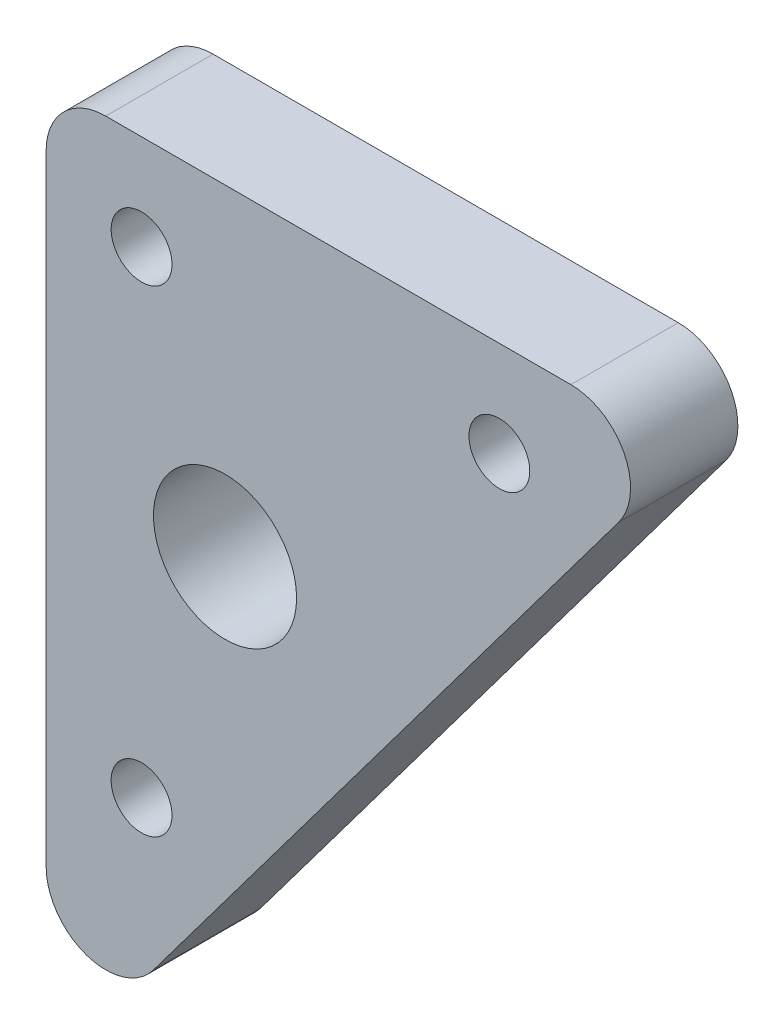
ISO-10303-21;
HEADER;
FILE_DESCRIPTION(('STEP AP214'),'2;1');
FILE_NAME('part.step','',(''),(''),'','','');
FILE_SCHEMA(('AUTOMOTIVE_DESIGN { 1 0 10303 214 1 1 1 1 }'));
ENDSEC;
DATA;
#1=APPLICATION_CONTEXT('core data for automotive mechanical design processes');
#2=APPLICATION_PROTOCOL_DEFINITION('international standard','automotive_design',2000,#1);
#3=PRODUCT_CONTEXT('',#1,'mechanical');
#4=PRODUCT('Part','Part','',(#3));
#5=PRODUCT_RELATED_PRODUCT_CATEGORY('part','',(#4));
#6=PRODUCT_DEFINITION_FORMATION('','',#4);
#7=PRODUCT_DEFINITION_CONTEXT('part definition',#1,'design');
#8=PRODUCT_DEFINITION('design','',#6,#7);
#9=PRODUCT_DEFINITION_SHAPE('','',#8);
#10=(LENGTH_UNIT() NAMED_UNIT(*) SI_UNIT(.MILLI.,.METRE.));
#11=(NAMED_UNIT(*) PLANE_ANGLE_UNIT() SI_UNIT($,.RADIAN.));
#12=(NAMED_UNIT(*) SI_UNIT($,.STERADIAN.) SOLID_ANGLE_UNIT());
#13=UNCERTAINTY_MEASURE_WITH_UNIT(LENGTH_MEASURE(1.E-05),#10,'distance_accuracy_value','');
#14=(GEOMETRIC_REPRESENTATION_CONTEXT(3) GLOBAL_UNCERTAINTY_ASSIGNED_CONTEXT((#13)) GLOBAL_UNIT_ASSIGNED_CONTEXT((#10,
#11,#12)) REPRESENTATION_CONTEXT('',''));
#15=CARTESIAN_POINT('',(0.,0.,0.));
#16=DIRECTION('',(0.,0.,1.));
#17=DIRECTION('',(1.,0.,0.));
#18=AXIS2_PLACEMENT_3D('',#15,#16,#17);
#19=CARTESIAN_POINT('',(0.,0.,9.));
#20=DIRECTION('',(0.,0.,-1.));
#21=DIRECTION('',(-1.,0.,0.));
#22=AXIS2_PLACEMENT_3D('',#19,#20,#21);
#23=PLANE('',#22);
#24=DIRECTION('',(0.,-1.,0.));
#25=VECTOR('',#24,1.);
#26=CARTESIAN_POINT('',(-19.7283950617284,-51.8395061728395,9.));
#27=LINE('',#26,#25);
#28=CARTESIAN_POINT('',(-19.7283950617284,15.1604938271605,9.));
#29=VERTEX_POINT('',#28);
#30=CARTESIAN_POINT('',(-19.7283950617284,-36.8395061728395,9.));
#31=VERTEX_POINT('',#30);
#32=EDGE_CURVE('E118',#29,#31,#27,.T.);
#33=ORIENTED_EDGE('',*,*,#32,.T.);
#34=CARTESIAN_POINT('',(-14.7283950617284,-36.8395061728395,9.));
#35=DIRECTION('',(0.,0.,-1.));
#36=DIRECTION('',(-1.,0.,0.));
#37=AXIS2_PLACEMENT_3D('',#34,#35,#36);
#38=CIRCLE('',#37,5.);
#39=CARTESIAN_POINT('',(-10.7283950617284,-39.8395061728395,9.));
#40=VERTEX_POINT('',#39);
#41=EDGE_CURVE('E134',#31,#40,#38,.F.);
#42=ORIENTED_EDGE('',*,*,#41,.T.);
#43=DIRECTION('',(0.6,0.8,0.));
#44=VECTOR('',#43,1.);
#45=CARTESIAN_POINT('',(34.2716049382716,20.1604938271605,9.));
#46=LINE('',#45,#44);
#47=CARTESIAN_POINT('',(28.2716049382716,12.1604938271605,9.));
#48=VERTEX_POINT('',#47);
#49=EDGE_CURVE('E108',#40,#48,#46,.T.);
#50=ORIENTED_EDGE('',*,*,#49,.T.);
#51=CARTESIAN_POINT('',(24.2716049382716,15.1604938271605,9.));
#52=DIRECTION('',(0.,0.,-1.));
#53=DIRECTION('',(-1.,0.,0.));
#54=AXIS2_PLACEMENT_3D('',#51,#52,#53);
#55=CIRCLE('',#54,5.);
#56=CARTESIAN_POINT('',(24.2716049382716,20.1604938271605,9.));
#57=VERTEX_POINT('',#56);
#58=EDGE_CURVE('E56',#48,#57,#55,.F.);
#59=ORIENTED_EDGE('',*,*,#58,.T.);
#60=DIRECTION('',(-1.,0.,0.));
#61=VECTOR('',#60,1.);
#62=CARTESIAN_POINT('',(-19.7283950617284,20.1604938271605,9.));
#63=LINE('',#62,#61);
#64=CARTESIAN_POINT('',(-14.7283950617284,20.1604938271605,9.));
#65=VERTEX_POINT('',#64);
#66=EDGE_CURVE('E124',#57,#65,#63,.T.);
#67=ORIENTED_EDGE('',*,*,#66,.T.);
#68=CARTESIAN_POINT('',(-14.7283950617284,15.1604938271605,9.));
#69=DIRECTION('',(0.,0.,-1.));
#70=DIRECTION('',(-1.,0.,0.));
#71=AXIS2_PLACEMENT_3D('',#68,#69,#70);
#72=CIRCLE('',#71,5.);
#73=EDGE_CURVE('E131',#65,#29,#72,.F.);
#74=ORIENTED_EDGE('',*,*,#73,.T.);
#75=EDGE_LOOP('',(#33,#42,#50,#59,#67,#74));
#76=FACE_BOUND('',#75,.T.);
#77=CARTESIAN_POINT('',(-11.7283950617284,12.1604938271605,9.));
#78=DIRECTION('',(0.,0.,1.));
#79=DIRECTION('',(1.,0.,0.));
#80=AXIS2_PLACEMENT_3D('',#77,#78,#79);
#81=CIRCLE('',#80,2.55);
#82=CARTESIAN_POINT('',(-9.17839506172839,12.1604938271605,9.));
#83=VERTEX_POINT('',#82);
#84=EDGE_CURVE('E120',#83,#83,#81,.T.);
#85=ORIENTED_EDGE('',*,*,#84,.F.);
#86=EDGE_LOOP('',(#85));
#87=FACE_BOUND('',#86,.T.);
#88=CARTESIAN_POINT('',(18.2716049382716,12.1604938271605,9.));
#89=DIRECTION('',(0.,0.,1.));
#90=DIRECTION('',(1.,0.,0.));
#91=AXIS2_PLACEMENT_3D('',#88,#89,#90);
#92=CIRCLE('',#91,2.55);
#93=CARTESIAN_POINT('',(20.8216049382716,12.1604938271605,9.));
#94=VERTEX_POINT('',#93);
#95=EDGE_CURVE('E273',#94,#94,#92,.T.);
#96=ORIENTED_EDGE('',*,*,#95,.F.);
#97=EDGE_LOOP('',(#96));
#98=FACE_BOUND('',#97,.T.);
#99=CARTESIAN_POINT('',(-11.7283950617284,-27.8395061728395,9.));
#100=DIRECTION('',(0.,0.,1.));
#101=DIRECTION('',(1.,0.,0.));
#102=AXIS2_PLACEMENT_3D('',#99,#100,#101);
#103=CIRCLE('',#102,2.55);
#104=CARTESIAN_POINT('',(-9.17839506172839,-27.8395061728395,9.));
#105=VERTEX_POINT('',#104);
#106=EDGE_CURVE('E267',#105,#105,#103,.T.);
#107=ORIENTED_EDGE('',*,*,#106,.F.);
#108=EDGE_LOOP('',(#107));
#109=FACE_BOUND('',#108,.T.);
#110=CARTESIAN_POINT('',(-4.72839506172839,-6.83950617283951,9.));
#111=DIRECTION('',(0.,0.,1.));
#112=DIRECTION('',(1.,0.,0.));
#113=AXIS2_PLACEMENT_3D('',#110,#111,#112);
#114=CIRCLE('',#113,6.);
#115=CARTESIAN_POINT('',(1.27160493827161,-6.83950617283951,9.));
#116=VERTEX_POINT('',#115);
#117=EDGE_CURVE('E258',#116,#116,#114,.T.);
#118=ORIENTED_EDGE('',*,*,#117,.F.);
#119=EDGE_LOOP('',(#118));
#120=FACE_BOUND('',#119,.T.);
#121=ADVANCED_FACE('F35',(#76,#87,#98,#109,#120),#23,.F.);
#122=CARTESIAN_POINT('',(0.,0.,0.));
#123=DIRECTION('',(0.,0.,-1.));
#124=DIRECTION('',(-1.,0.,0.));
#125=AXIS2_PLACEMENT_3D('',#122,#123,#124);
#126=PLANE('',#125);
#127=CARTESIAN_POINT('',(-11.7283950617284,-27.8395061728395,0.));
#128=DIRECTION('',(0.,0.,1.));
#129=DIRECTION('',(1.,0.,0.));
#130=AXIS2_PLACEMENT_3D('',#127,#128,#129);
#131=CIRCLE('',#130,2.55);
#132=CARTESIAN_POINT('',(-9.17839506172839,-27.8395061728395,0.));
#133=VERTEX_POINT('',#132);
#134=EDGE_CURVE('E264',#133,#133,#131,.T.);
#135=ORIENTED_EDGE('',*,*,#134,.T.);
#136=EDGE_LOOP('',(#135));
#137=FACE_BOUND('',#136,.T.);
#138=CARTESIAN_POINT('',(-11.7283950617284,12.1604938271605,0.));
#139=DIRECTION('',(0.,0.,1.));
#140=DIRECTION('',(1.,0.,0.));
#141=AXIS2_PLACEMENT_3D('',#138,#139,#140);
#142=CIRCLE('',#141,2.55);
#143=CARTESIAN_POINT('',(-9.17839506172839,12.1604938271605,0.));
#144=VERTEX_POINT('',#143);
#145=EDGE_CURVE('E144',#144,#144,#142,.T.);
#146=ORIENTED_EDGE('',*,*,#145,.T.);
#147=EDGE_LOOP('',(#146));
#148=FACE_BOUND('',#147,.T.);
#149=DIRECTION('',(0.6,0.8,0.));
#150=VECTOR('',#149,1.);
#151=CARTESIAN_POINT('',(34.2716049382716,20.1604938271605,0.));
#152=LINE('',#151,#150);
#153=CARTESIAN_POINT('',(-10.7283950617284,-39.8395061728395,0.));
#154=VERTEX_POINT('',#153);
#155=CARTESIAN_POINT('',(28.2716049382716,12.1604938271605,0.));
#156=VERTEX_POINT('',#155);
#157=EDGE_CURVE('E106',#154,#156,#152,.T.);
#158=ORIENTED_EDGE('',*,*,#157,.F.);
#159=CARTESIAN_POINT('',(-14.7283950617284,-36.8395061728395,0.));
#160=DIRECTION('',(0.,0.,-1.));
#161=DIRECTION('',(-1.,0.,0.));
#162=AXIS2_PLACEMENT_3D('',#159,#160,#161);
#163=CIRCLE('',#162,5.);
#164=CARTESIAN_POINT('',(-19.7283950617284,-36.8395061728395,0.));
#165=VERTEX_POINT('',#164);
#166=EDGE_CURVE('E89',#154,#165,#163,.T.);
#167=ORIENTED_EDGE('',*,*,#166,.T.);
#168=DIRECTION('',(0.,-1.,0.));
#169=VECTOR('',#168,1.);
#170=CARTESIAN_POINT('',(-19.7283950617284,-51.8395061728395,0.));
#171=LINE('',#170,#169);
#172=CARTESIAN_POINT('',(-19.7283950617284,15.1604938271605,0.));
#173=VERTEX_POINT('',#172);
#174=EDGE_CURVE('E116',#173,#165,#171,.T.);
#175=ORIENTED_EDGE('',*,*,#174,.F.);
#176=CARTESIAN_POINT('',(-14.7283950617284,15.1604938271605,0.));
#177=DIRECTION('',(0.,0.,-1.));
#178=DIRECTION('',(-1.,0.,0.));
#179=AXIS2_PLACEMENT_3D('',#176,#177,#178);
#180=CIRCLE('',#179,5.);
#181=CARTESIAN_POINT('',(-14.7283950617284,20.1604938271605,0.));
#182=VERTEX_POINT('',#181);
#183=EDGE_CURVE('E109',#173,#182,#180,.T.);
#184=ORIENTED_EDGE('',*,*,#183,.T.);
#185=DIRECTION('',(-1.,0.,0.));
#186=VECTOR('',#185,1.);
#187=CARTESIAN_POINT('',(-19.7283950617284,20.1604938271605,0.));
#188=LINE('',#187,#186);
#189=CARTESIAN_POINT('',(24.2716049382716,20.1604938271605,0.));
#190=VERTEX_POINT('',#189);
#191=EDGE_CURVE('E115',#190,#182,#188,.T.);
#192=ORIENTED_EDGE('',*,*,#191,.F.);
#193=CARTESIAN_POINT('',(24.2716049382716,15.1604938271605,0.));
#194=DIRECTION('',(0.,0.,-1.));
#195=DIRECTION('',(-1.,0.,0.));
#196=AXIS2_PLACEMENT_3D('',#193,#194,#195);
#197=CIRCLE('',#196,5.);
#198=EDGE_CURVE('E100',#190,#156,#197,.T.);
#199=ORIENTED_EDGE('',*,*,#198,.T.);
#200=EDGE_LOOP('',(#158,#167,#175,#184,#192,#199));
#201=FACE_BOUND('',#200,.T.);
#202=CARTESIAN_POINT('',(18.2716049382716,12.1604938271605,0.));
#203=DIRECTION('',(0.,0.,1.));
#204=DIRECTION('',(1.,0.,0.));
#205=AXIS2_PLACEMENT_3D('',#202,#203,#204);
#206=CIRCLE('',#205,2.55);
#207=CARTESIAN_POINT('',(20.8216049382716,12.1604938271605,0.));
#208=VERTEX_POINT('',#207);
#209=EDGE_CURVE('E270',#208,#208,#206,.T.);
#210=ORIENTED_EDGE('',*,*,#209,.T.);
#211=EDGE_LOOP('',(#210));
#212=FACE_BOUND('',#211,.T.);
#213=CARTESIAN_POINT('',(-4.72839506172839,-6.83950617283951,0.));
#214=DIRECTION('',(0.,0.,1.));
#215=DIRECTION('',(1.,0.,0.));
#216=AXIS2_PLACEMENT_3D('',#213,#214,#215);
#217=CIRCLE('',#216,6.);
#218=CARTESIAN_POINT('',(1.27160493827161,-6.83950617283951,0.));
#219=VERTEX_POINT('',#218);
#220=EDGE_CURVE('E261',#219,#219,#217,.T.);
#221=ORIENTED_EDGE('',*,*,#220,.T.);
#222=EDGE_LOOP('',(#221));
#223=FACE_BOUND('',#222,.T.);
#224=ADVANCED_FACE('F112',(#137,#148,#201,#212,#223),#126,.T.);
#225=CARTESIAN_POINT('',(-19.7283950617284,-51.8395061728395,9.));
#226=DIRECTION('',(1.,0.,0.));
#227=DIRECTION('',(0.,1.,0.));
#228=AXIS2_PLACEMENT_3D('',#225,#226,#227);
#229=PLANE('',#228);
#230=ORIENTED_EDGE('',*,*,#174,.T.);
#231=DIRECTION('',(0.,0.,-1.));
#232=VECTOR('',#231,1.);
#233=CARTESIAN_POINT('',(-19.7283950617284,-36.8395061728395,9.));
#234=LINE('',#233,#232);
#235=EDGE_CURVE('E94',#165,#31,#234,.F.);
#236=ORIENTED_EDGE('',*,*,#235,.T.);
#237=ORIENTED_EDGE('',*,*,#32,.F.);
#238=DIRECTION('',(0.,0.,-1.));
#239=VECTOR('',#238,1.);
#240=CARTESIAN_POINT('',(-19.7283950617284,15.1604938271605,9.));
#241=LINE('',#240,#239);
#242=EDGE_CURVE('E99',#29,#173,#241,.T.);
#243=ORIENTED_EDGE('',*,*,#242,.T.);
#244=EDGE_LOOP('',(#230,#236,#237,#243));
#245=FACE_BOUND('',#244,.T.);
#246=ADVANCED_FACE('F148',(#245),#229,.F.);
#247=CARTESIAN_POINT('',(34.2716049382716,20.1604938271605,9.));
#248=DIRECTION('',(-0.8,0.6,0.));
#249=DIRECTION('',(-0.6,-0.8,0.));
#250=AXIS2_PLACEMENT_3D('',#247,#248,#249);
#251=PLANE('',#250);
#252=ORIENTED_EDGE('',*,*,#49,.F.);
#253=DIRECTION('',(0.,0.,-1.));
#254=VECTOR('',#253,1.);
#255=CARTESIAN_POINT('',(-10.7283950617284,-39.8395061728395,9.));
#256=LINE('',#255,#254);
#257=EDGE_CURVE('E93',#40,#154,#256,.T.);
#258=ORIENTED_EDGE('',*,*,#257,.T.);
#259=ORIENTED_EDGE('',*,*,#157,.T.);
#260=DIRECTION('',(0.,0.,-1.));
#261=VECTOR('',#260,1.);
#262=CARTESIAN_POINT('',(28.2716049382716,12.1604938271605,9.));
#263=LINE('',#262,#261);
#264=EDGE_CURVE('E110',#156,#48,#263,.F.);
#265=ORIENTED_EDGE('',*,*,#264,.T.);
#266=EDGE_LOOP('',(#252,#258,#259,#265));
#267=FACE_BOUND('',#266,.T.);
#268=ADVANCED_FACE('F105',(#267),#251,.F.);
#269=CARTESIAN_POINT('',(-19.7283950617284,20.1604938271605,9.));
#270=DIRECTION('',(0.,-1.,0.));
#271=DIRECTION('',(0.,0.,-1.));
#272=AXIS2_PLACEMENT_3D('',#269,#270,#271);
#273=PLANE('',#272);
#274=ORIENTED_EDGE('',*,*,#66,.F.);
#275=DIRECTION('',(0.,0.,-1.));
#276=VECTOR('',#275,1.);
#277=CARTESIAN_POINT('',(24.2716049382716,20.1604938271605,9.));
#278=LINE('',#277,#276);
#279=EDGE_CURVE('E11',#57,#190,#278,.T.);
#280=ORIENTED_EDGE('',*,*,#279,.T.);
#281=ORIENTED_EDGE('',*,*,#191,.T.);
#282=DIRECTION('',(0.,0.,-1.));
#283=VECTOR('',#282,1.);
#284=CARTESIAN_POINT('',(-14.7283950617284,20.1604938271605,9.));
#285=LINE('',#284,#283);
#286=EDGE_CURVE('E43',#182,#65,#285,.F.);
#287=ORIENTED_EDGE('',*,*,#286,.T.);
#288=EDGE_LOOP('',(#274,#280,#281,#287));
#289=FACE_BOUND('',#288,.T.);
#290=ADVANCED_FACE('F149',(#289),#273,.F.);
#291=CARTESIAN_POINT('',(-11.7283950617284,12.1604938271605,9.));
#292=DIRECTION('',(0.,0.,-1.));
#293=DIRECTION('',(-1.,0.,0.));
#294=AXIS2_PLACEMENT_3D('',#291,#292,#293);
#295=CYLINDRICAL_SURFACE('',#294,2.55);
#296=ORIENTED_EDGE('',*,*,#84,.T.);
#297=EDGE_LOOP('',(#296));
#298=FACE_BOUND('',#297,.T.);
#299=ORIENTED_EDGE('',*,*,#145,.F.);
#300=EDGE_LOOP('',(#299));
#301=FACE_BOUND('',#300,.T.);
#302=ADVANCED_FACE('F167',(#298,#301),#295,.F.);
#303=CARTESIAN_POINT('',(18.2716049382716,12.1604938271605,9.));
#304=DIRECTION('',(0.,0.,-1.));
#305=DIRECTION('',(-1.,0.,0.));
#306=AXIS2_PLACEMENT_3D('',#303,#304,#305);
#307=CYLINDRICAL_SURFACE('',#306,2.55);
#308=ORIENTED_EDGE('',*,*,#95,.T.);
#309=EDGE_LOOP('',(#308));
#310=FACE_BOUND('',#309,.T.);
#311=ORIENTED_EDGE('',*,*,#209,.F.);
#312=EDGE_LOOP('',(#311));
#313=FACE_BOUND('',#312,.T.);
#314=ADVANCED_FACE('F194',(#310,#313),#307,.F.);
#315=CARTESIAN_POINT('',(-11.7283950617284,-27.8395061728395,9.));
#316=DIRECTION('',(0.,0.,-1.));
#317=DIRECTION('',(-1.,0.,0.));
#318=AXIS2_PLACEMENT_3D('',#315,#316,#317);
#319=CYLINDRICAL_SURFACE('',#318,2.55);
#320=ORIENTED_EDGE('',*,*,#106,.T.);
#321=EDGE_LOOP('',(#320));
#322=FACE_BOUND('',#321,.T.);
#323=ORIENTED_EDGE('',*,*,#134,.F.);
#324=EDGE_LOOP('',(#323));
#325=FACE_BOUND('',#324,.T.);
#326=ADVANCED_FACE('F201',(#322,#325),#319,.F.);
#327=CARTESIAN_POINT('',(-4.72839506172839,-6.83950617283951,9.));
#328=DIRECTION('',(0.,0.,-1.));
#329=DIRECTION('',(-1.,0.,0.));
#330=AXIS2_PLACEMENT_3D('',#327,#328,#329);
#331=CYLINDRICAL_SURFACE('',#330,6.);
#332=ORIENTED_EDGE('',*,*,#117,.T.);
#333=EDGE_LOOP('',(#332));
#334=FACE_BOUND('',#333,.T.);
#335=ORIENTED_EDGE('',*,*,#220,.F.);
#336=EDGE_LOOP('',(#335));
#337=FACE_BOUND('',#336,.T.);
#338=ADVANCED_FACE('F157',(#334,#337),#331,.F.);
#339=CARTESIAN_POINT('',(-14.7283950617284,-36.8395061728395,9.));
#340=DIRECTION('',(0.,0.,-1.));
#341=DIRECTION('',(-1.,0.,0.));
#342=AXIS2_PLACEMENT_3D('',#339,#340,#341);
#343=CYLINDRICAL_SURFACE('',#342,5.);
#344=ORIENTED_EDGE('',*,*,#41,.F.);
#345=ORIENTED_EDGE('',*,*,#235,.F.);
#346=ORIENTED_EDGE('',*,*,#166,.F.);
#347=ORIENTED_EDGE('',*,*,#257,.F.);
#348=EDGE_LOOP('',(#344,#345,#346,#347));
#349=FACE_BOUND('',#348,.T.);
#350=ADVANCED_FACE('F92',(#349),#343,.T.);
#351=CARTESIAN_POINT('',(24.2716049382716,15.1604938271605,9.));
#352=DIRECTION('',(0.,0.,-1.));
#353=DIRECTION('',(-1.,0.,0.));
#354=AXIS2_PLACEMENT_3D('',#351,#352,#353);
#355=CYLINDRICAL_SURFACE('',#354,5.);
#356=ORIENTED_EDGE('',*,*,#58,.F.);
#357=ORIENTED_EDGE('',*,*,#264,.F.);
#358=ORIENTED_EDGE('',*,*,#198,.F.);
#359=ORIENTED_EDGE('',*,*,#279,.F.);
#360=EDGE_LOOP('',(#356,#357,#358,#359));
#361=FACE_BOUND('',#360,.T.);
#362=ADVANCED_FACE('F151',(#361),#355,.T.);
#363=CARTESIAN_POINT('',(-14.7283950617284,15.1604938271605,9.));
#364=DIRECTION('',(0.,0.,-1.));
#365=DIRECTION('',(-1.,0.,0.));
#366=AXIS2_PLACEMENT_3D('',#363,#364,#365);
#367=CYLINDRICAL_SURFACE('',#366,5.);
#368=ORIENTED_EDGE('',*,*,#73,.F.);
#369=ORIENTED_EDGE('',*,*,#286,.F.);
#370=ORIENTED_EDGE('',*,*,#183,.F.);
#371=ORIENTED_EDGE('',*,*,#242,.F.);
#372=EDGE_LOOP('',(#368,#369,#370,#371));
#373=FACE_BOUND('',#372,.T.);
#374=ADVANCED_FACE('F37',(#373),#367,.T.);
#375=CLOSED_SHELL('',(#121,#224,#246,#268,#290,#302,#314,#326,#338,#350,#362,#374));
#376=MANIFOLD_SOLID_BREP('B2',#375);
#377=ADVANCED_BREP_SHAPE_REPRESENTATION('',(#18,#376),#14);
#378=SHAPE_DEFINITION_REPRESENTATION(#9,#377);
ENDSEC;
END-ISO-10303-21;
